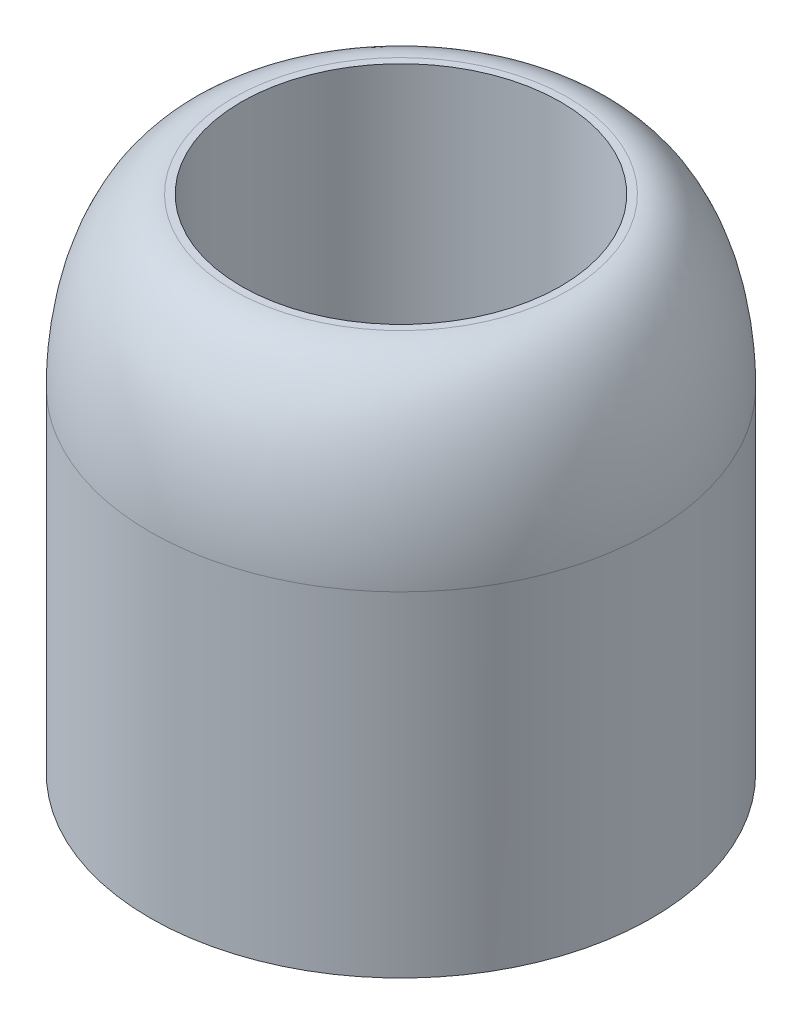
ISO-10303-21;
HEADER;
FILE_DESCRIPTION(('STEP AP214'),'2;1');
FILE_NAME('part.step','',(''),(''),'','','');
FILE_SCHEMA(('AUTOMOTIVE_DESIGN { 1 0 10303 214 1 1 1 1 }'));
ENDSEC;
DATA;
#1=APPLICATION_CONTEXT('core data for automotive mechanical design processes');
#2=APPLICATION_PROTOCOL_DEFINITION('international standard','automotive_design',2000,#1);
#3=PRODUCT_CONTEXT('',#1,'mechanical');
#4=PRODUCT('Part','Part','',(#3));
#5=PRODUCT_RELATED_PRODUCT_CATEGORY('part','',(#4));
#6=PRODUCT_DEFINITION_FORMATION('','',#4);
#7=PRODUCT_DEFINITION_CONTEXT('part definition',#1,'design');
#8=PRODUCT_DEFINITION('design','',#6,#7);
#9=PRODUCT_DEFINITION_SHAPE('','',#8);
#10=(LENGTH_UNIT() NAMED_UNIT(*) SI_UNIT(.MILLI.,.METRE.));
#11=(NAMED_UNIT(*) PLANE_ANGLE_UNIT() SI_UNIT($,.RADIAN.));
#12=(NAMED_UNIT(*) SI_UNIT($,.STERADIAN.) SOLID_ANGLE_UNIT());
#13=UNCERTAINTY_MEASURE_WITH_UNIT(LENGTH_MEASURE(1.E-05),#10,'distance_accuracy_value','');
#14=(GEOMETRIC_REPRESENTATION_CONTEXT(3) GLOBAL_UNCERTAINTY_ASSIGNED_CONTEXT((#13)) GLOBAL_UNIT_ASSIGNED_CONTEXT((#10,
#11,#12)) REPRESENTATION_CONTEXT('',''));
#15=CARTESIAN_POINT('',(0.,0.,0.));
#16=DIRECTION('',(0.,0.,1.));
#17=DIRECTION('',(1.,0.,0.));
#18=AXIS2_PLACEMENT_3D('',#15,#16,#17);
#19=CARTESIAN_POINT('',(0.,60.,0.));
#20=DIRECTION('',(0.,-1.,0.));
#21=DIRECTION('',(0.,0.,-1.));
#22=AXIS2_PLACEMENT_3D('',#19,#20,#21);
#23=CYLINDRICAL_SURFACE('',#22,19.1);
#24=CARTESIAN_POINT('',(0.,60.,0.));
#25=DIRECTION('',(0.,1.,0.));
#26=DIRECTION('',(0.,0.,1.));
#27=AXIS2_PLACEMENT_3D('',#24,#25,#26);
#28=CIRCLE('',#27,19.1);
#29=CARTESIAN_POINT('',(0.,60.,19.1));
#30=VERTEX_POINT('',#29);
#31=EDGE_CURVE('E72',#30,#30,#28,.T.);
#32=ORIENTED_EDGE('',*,*,#31,.T.);
#33=EDGE_LOOP('',(#32));
#34=FACE_BOUND('',#33,.T.);
#35=CARTESIAN_POINT('',(0.,20.,0.));
#36=DIRECTION('',(0.,-1.,0.));
#37=DIRECTION('',(0.,0.,-1.));
#38=AXIS2_PLACEMENT_3D('',#35,#36,#37);
#39=CIRCLE('',#38,19.1);
#40=CARTESIAN_POINT('',(0.,20.,-19.1));
#41=VERTEX_POINT('',#40);
#42=EDGE_CURVE('E78',#41,#41,#39,.T.);
#43=ORIENTED_EDGE('',*,*,#42,.T.);
#44=EDGE_LOOP('',(#43));
#45=FACE_BOUND('',#44,.T.);
#46=ADVANCED_FACE('F46',(#34,#45),#23,.F.);
#47=CARTESIAN_POINT('',(0.,60.,0.));
#48=DIRECTION('',(0.,1.,0.));
#49=DIRECTION('',(0.,0.,1.));
#50=AXIS2_PLACEMENT_3D('',#47,#48,#49);
#51=PLANE('',#50);
#52=CARTESIAN_POINT('',(0.,60.,20.));
#53=CARTESIAN_POINT('',(-2.61799387690403,60.,20.));
#54=CARTESIAN_POINT('',(-5.23495768819361,60.,19.4794535329497));
#55=CARTESIAN_POINT('',(-10.07237960641,60.,17.4757277675017));
#56=CARTESIAN_POINT('',(-12.2909344002713,60.,15.9933368471906));
#57=CARTESIAN_POINT('',(-15.9933368471907,60.,12.2909344002712));
#58=CARTESIAN_POINT('',(-17.4757277675017,60.,10.0723796064088));
#59=CARTESIAN_POINT('',(-19.4794535329498,60.,5.23495768819469));
#60=CARTESIAN_POINT('',(-20.,60.,2.6179938769007));
#61=CARTESIAN_POINT('',(-20.,60.,-2.61799387690063));
#62=CARTESIAN_POINT('',(-19.4794535329497,60.,-5.23495768819361));
#63=CARTESIAN_POINT('',(-17.4757277675017,60.,-10.07237960641));
#64=CARTESIAN_POINT('',(-15.9933368471929,60.,-12.290934400269));
#65=CARTESIAN_POINT('',(-12.290934400269,60.,-15.9933368471929));
#66=CARTESIAN_POINT('',(-10.0723796064088,60.,-17.4757277675017));
#67=CARTESIAN_POINT('',(-5.2349576881947,60.,-19.4794535329498));
#68=CARTESIAN_POINT('',(-2.61799387690066,60.,-20.));
#69=CARTESIAN_POINT('',(2.61799387690067,60.,-20.));
#70=CARTESIAN_POINT('',(5.23495768819248,60.,-19.4794535329452));
#71=CARTESIAN_POINT('',(10.0723796064112,60.,-17.4757277675062));
#72=CARTESIAN_POINT('',(12.290934400269,60.,-15.9933368471929));
#73=CARTESIAN_POINT('',(15.9933368471929,60.,-12.290934400269));
#74=CARTESIAN_POINT('',(17.4757277675062,60.,-10.0723796064118));
#75=CARTESIAN_POINT('',(19.4794535329453,60.,-5.23495768819185));
#76=CARTESIAN_POINT('',(20.,60.,-2.61799387690066));
#77=CARTESIAN_POINT('',(20.,60.,2.61799387690066));
#78=CARTESIAN_POINT('',(19.4794535329499,60.,5.2349576881941));
#79=CARTESIAN_POINT('',(17.4757277675016,60.,10.0723796064095));
#80=CARTESIAN_POINT('',(15.9933368471911,60.,12.2909344002708));
#81=CARTESIAN_POINT('',(12.2909344002708,60.,15.9933368471911));
#82=CARTESIAN_POINT('',(10.0723796064114,60.,17.4757277674994));
#83=CARTESIAN_POINT('',(5.23495768819215,60.,19.4794535329521));
#84=CARTESIAN_POINT('',(2.61799387690402,60.,20.));
#85=CARTESIAN_POINT('',(0.,60.,20.));
#86=(BOUNDED_CURVE() B_SPLINE_CURVE(3,(#52,#53,#54,#55,#56,#57,#58,#59,#60,#61,#62,#63,#64,#65,
#66,#67,#68,#69,#70,#71,#72,#73,#74,#75,#76,#77,#78,#79,#80,#81,#82,#83,#84,#85),.UNSPECIFIED.,
.T.,.F.) B_SPLINE_CURVE_WITH_KNOTS((4,2,2,2,2,2,2,2,2,2,2,2,2,2,2,2,4),(0.,0.392699081698725,
0.785398163397448,1.17809724509617,1.5707963267949,1.96349540849362,2.35619449019234,
2.74889357189107,3.14159265358979,3.53429173528852,3.92699081698724,4.31968989868597,
4.71238898038469,5.10508806208341,5.49778714378214,5.89048622548086,6.28318530717959),
.UNSPECIFIED.) CURVE() GEOMETRIC_REPRESENTATION_ITEM() RATIONAL_B_SPLINE_CURVE((1.,1.,1.,1.,1.,
1.,1.,1.,1.,1.,1.,1.,1.,1.,1.,1.,1.,1.,1.,1.,1.,1.,1.,1.,1.,1.,1.,1.,1.,1.,1.,1.,1.,1.)) REPRESENTATION_ITEM(''));
#87=CARTESIAN_POINT('',(0.,60.,20.));
#88=VERTEX_POINT('',#87);
#89=EDGE_CURVE('E60',#88,#88,#86,.F.);
#90=ORIENTED_EDGE('',*,*,#89,.T.);
#91=EDGE_LOOP('',(#90));
#92=FACE_BOUND('',#91,.T.);
#93=ORIENTED_EDGE('',*,*,#31,.F.);
#94=EDGE_LOOP('',(#93));
#95=FACE_BOUND('',#94,.T.);
#96=ADVANCED_FACE('F90',(#92,#95),#51,.T.);
#97=CARTESIAN_POINT('',(0.,0.,0.));
#98=DIRECTION('',(0.,1.,0.));
#99=DIRECTION('',(0.,0.,1.));
#100=AXIS2_PLACEMENT_3D('',#97,#98,#99);
#101=PLANE('',#100);
#102=CARTESIAN_POINT('',(0.,0.,0.));
#103=DIRECTION('',(0.,-1.,0.));
#104=DIRECTION('',(0.,0.,-1.));
#105=AXIS2_PLACEMENT_3D('',#102,#103,#104);
#106=CIRCLE('',#105,26.);
#107=CARTESIAN_POINT('',(0.,0.,-26.));
#108=VERTEX_POINT('',#107);
#109=EDGE_CURVE('E145',#108,#108,#106,.T.);
#110=ORIENTED_EDGE('',*,*,#109,.F.);
#111=EDGE_LOOP('',(#110));
#112=FACE_BOUND('',#111,.T.);
#113=CARTESIAN_POINT('',(0.,0.,0.));
#114=DIRECTION('',(0.,1.,0.));
#115=DIRECTION('',(0.,0.,1.));
#116=AXIS2_PLACEMENT_3D('',#113,#114,#115);
#117=CIRCLE('',#116,30.);
#118=CARTESIAN_POINT('',(0.,0.,30.));
#119=VERTEX_POINT('',#118);
#120=EDGE_CURVE('E66',#119,#119,#117,.T.);
#121=ORIENTED_EDGE('',*,*,#120,.F.);
#122=EDGE_LOOP('',(#121));
#123=FACE_BOUND('',#122,.T.);
#124=ADVANCED_FACE('F100',(#112,#123),#101,.F.);
#125=CARTESIAN_POINT('',(0.,60.,0.));
#126=DIRECTION('',(0.,-1.,0.));
#127=DIRECTION('',(0.,0.,-1.));
#128=AXIS2_PLACEMENT_3D('',#125,#126,#127);
#129=CYLINDRICAL_SURFACE('',#128,30.);
#130=CARTESIAN_POINT('',(0.,40.,30.));
#131=CARTESIAN_POINT('',(3.92699081535604,40.,30.));
#132=CARTESIAN_POINT('',(7.85243653228777,40.,29.2191802994243));
#133=CARTESIAN_POINT('',(15.1085694096176,40.,26.2135916512529));
#134=CARTESIAN_POINT('',(18.4364016004074,40.,23.9900052707855));
#135=CARTESIAN_POINT('',(23.9900052707855,40.,18.4364016004074));
#136=CARTESIAN_POINT('',(26.2135916512531,40.,15.1085694096173));
#137=CARTESIAN_POINT('',(29.2191802994241,40.,7.85243653228805));
#138=CARTESIAN_POINT('',(30.,40.,3.926990815351));
#139=CARTESIAN_POINT('',(30.,40.,-3.92699081535099));
#140=CARTESIAN_POINT('',(29.2191802994236,40.,-7.85243653228935));
#141=CARTESIAN_POINT('',(26.2135916512536,40.,-15.1085694096161));
#142=CARTESIAN_POINT('',(23.9900052707916,40.,-18.4364016004012));
#143=CARTESIAN_POINT('',(18.4364016004012,40.,-23.9900052707917));
#144=CARTESIAN_POINT('',(15.1085694096135,40.,-26.2135916512546));
#145=CARTESIAN_POINT('',(7.85243653229199,40.,-29.2191802994225));
#146=CARTESIAN_POINT('',(3.926990815351,40.,-30.));
#147=CARTESIAN_POINT('',(-3.92699081535099,40.,-30.));
#148=CARTESIAN_POINT('',(-7.85243653229257,40.,-29.2191802994223));
#149=CARTESIAN_POINT('',(-15.1085694096127,40.,-26.213591651255));
#150=CARTESIAN_POINT('',(-18.4364016004012,40.,-23.9900052707916));
#151=CARTESIAN_POINT('',(-23.9900052707916,40.,-18.4364016004012));
#152=CARTESIAN_POINT('',(-26.2135916512541,40.,-15.1085694096147));
#153=CARTESIAN_POINT('',(-29.2191802994231,40.,-7.85243653229071));
#154=CARTESIAN_POINT('',(-30.,40.,-3.92699081535095));
#155=CARTESIAN_POINT('',(-30.,40.,3.92699081535105));
#156=CARTESIAN_POINT('',(-29.2191802994223,40.,7.85243653229256));
#157=CARTESIAN_POINT('',(-26.213591651255,40.,15.1085694096127));
#158=CARTESIAN_POINT('',(-23.9900052707871,40.,18.4364016004057));
#159=CARTESIAN_POINT('',(-18.4364016004058,40.,23.990005270787));
#160=CARTESIAN_POINT('',(-15.1085694096151,40.,26.213591651254));
#161=CARTESIAN_POINT('',(-7.85243653229038,40.,29.2191802994232));
#162=CARTESIAN_POINT('',(-3.92699081535604,40.,30.));
#163=CARTESIAN_POINT('',(0.,40.,30.));
#164=(BOUNDED_CURVE() B_SPLINE_CURVE(3,(#130,#131,#132,#133,#134,#135,#136,#137,#138,#139,#140,
#141,#142,#143,#144,#145,#146,#147,#148,#149,#150,#151,#152,#153,#154,#155,#156,#157,#158,#159,
#160,#161,#162,#163),.UNSPECIFIED.,.T.,.F.) B_SPLINE_CURVE_WITH_KNOTS((4,2,2,2,2,2,2,2,2,2,2,2,
2,2,2,2,4),(0.,0.392699081698724,0.785398163397448,1.17809724509617,1.5707963267949,
1.96349540849362,2.35619449019234,2.74889357189107,3.14159265358979,3.53429173528852,
3.92699081698724,4.31968989868597,4.71238898038469,5.10508806208341,5.49778714378214,
5.89048622548086,6.28318530717959),
.UNSPECIFIED.) CURVE() GEOMETRIC_REPRESENTATION_ITEM() RATIONAL_B_SPLINE_CURVE((1.,1.,1.,1.,1.,
1.,1.,1.,1.,1.,1.,1.,1.,1.,1.,1.,1.,1.,1.,1.,1.,1.,1.,1.,1.,1.,1.,1.,1.,1.,1.,1.,1.,1.)) REPRESENTATION_ITEM(''));
#165=CARTESIAN_POINT('',(0.,40.,30.));
#166=VERTEX_POINT('',#165);
#167=EDGE_CURVE('E11',#166,#166,#164,.F.);
#168=ORIENTED_EDGE('',*,*,#167,.T.);
#169=EDGE_LOOP('',(#168));
#170=FACE_BOUND('',#169,.T.);
#171=ORIENTED_EDGE('',*,*,#120,.T.);
#172=EDGE_LOOP('',(#171));
#173=FACE_BOUND('',#172,.T.);
#174=ADVANCED_FACE('F103',(#170,#173),#129,.T.);
#175=CARTESIAN_POINT('',(0.,20.,0.));
#176=DIRECTION('',(0.,-1.,0.));
#177=DIRECTION('',(0.,0.,-1.));
#178=AXIS2_PLACEMENT_3D('',#175,#176,#177);
#179=CYLINDRICAL_SURFACE('',#178,26.);
#180=CARTESIAN_POINT('',(0.,20.,0.));
#181=DIRECTION('',(0.,-1.,0.));
#182=DIRECTION('',(0.,0.,-1.));
#183=AXIS2_PLACEMENT_3D('',#180,#181,#182);
#184=CIRCLE('',#183,26.);
#185=CARTESIAN_POINT('',(0.,20.,-26.));
#186=VERTEX_POINT('',#185);
#187=EDGE_CURVE('E84',#186,#186,#184,.T.);
#188=ORIENTED_EDGE('',*,*,#187,.F.);
#189=EDGE_LOOP('',(#188));
#190=FACE_BOUND('',#189,.T.);
#191=ORIENTED_EDGE('',*,*,#109,.T.);
#192=EDGE_LOOP('',(#191));
#193=FACE_BOUND('',#192,.T.);
#194=ADVANCED_FACE('F107',(#190,#193),#179,.F.);
#195=CARTESIAN_POINT('',(0.,20.,0.));
#196=DIRECTION('',(0.,-1.,0.));
#197=DIRECTION('',(0.,0.,-1.));
#198=AXIS2_PLACEMENT_3D('',#195,#196,#197);
#199=PLANE('',#198);
#200=ORIENTED_EDGE('',*,*,#42,.F.);
#201=EDGE_LOOP('',(#200));
#202=FACE_BOUND('',#201,.T.);
#203=ORIENTED_EDGE('',*,*,#187,.T.);
#204=EDGE_LOOP('',(#203));
#205=FACE_BOUND('',#204,.T.);
#206=ADVANCED_FACE('F127',(#202,#205),#199,.T.);
#207=CARTESIAN_POINT('',(0.,60.,20.));
#208=CARTESIAN_POINT('',(2.61799387690402,60.,20.));
#209=CARTESIAN_POINT('',(5.23495768819215,60.,19.4794535329521));
#210=CARTESIAN_POINT('',(10.0723796064114,60.,17.4757277674994));
#211=CARTESIAN_POINT('',(12.2909344002708,60.,15.9933368471911));
#212=CARTESIAN_POINT('',(15.9933368471911,60.,12.2909344002708));
#213=CARTESIAN_POINT('',(17.4757277675016,60.,10.0723796064095));
#214=CARTESIAN_POINT('',(19.4794535329499,60.,5.2349576881941));
#215=CARTESIAN_POINT('',(20.,60.,2.61799387690066));
#216=CARTESIAN_POINT('',(20.,60.,-2.61799387690066));
#217=CARTESIAN_POINT('',(19.4794535329453,60.,-5.23495768819185));
#218=CARTESIAN_POINT('',(17.4757277675062,60.,-10.0723796064118));
#219=CARTESIAN_POINT('',(15.9933368471929,60.,-12.290934400269));
#220=CARTESIAN_POINT('',(12.290934400269,60.,-15.9933368471929));
#221=CARTESIAN_POINT('',(10.0723796064112,60.,-17.4757277675062));
#222=CARTESIAN_POINT('',(5.23495768819248,60.,-19.4794535329452));
#223=CARTESIAN_POINT('',(2.61799387690067,60.,-20.));
#224=CARTESIAN_POINT('',(-2.61799387690066,60.,-20.));
#225=CARTESIAN_POINT('',(-5.2349576881947,60.,-19.4794535329498));
#226=CARTESIAN_POINT('',(-10.0723796064088,60.,-17.4757277675017));
#227=CARTESIAN_POINT('',(-12.290934400269,60.,-15.9933368471929));
#228=CARTESIAN_POINT('',(-15.9933368471929,60.,-12.290934400269));
#229=CARTESIAN_POINT('',(-17.4757277675017,60.,-10.07237960641));
#230=CARTESIAN_POINT('',(-19.4794535329497,60.,-5.23495768819361));
#231=CARTESIAN_POINT('',(-20.,60.,-2.61799387690063));
#232=CARTESIAN_POINT('',(-20.,60.,2.6179938769007));
#233=CARTESIAN_POINT('',(-19.4794535329498,60.,5.23495768819469));
#234=CARTESIAN_POINT('',(-17.4757277675017,60.,10.0723796064088));
#235=CARTESIAN_POINT('',(-15.9933368471907,60.,12.2909344002712));
#236=CARTESIAN_POINT('',(-12.2909344002713,60.,15.9933368471906));
#237=CARTESIAN_POINT('',(-10.07237960641,60.,17.4757277675017));
#238=CARTESIAN_POINT('',(-5.23495768819361,60.,19.4794535329497));
#239=CARTESIAN_POINT('',(-2.61799387690403,60.,20.));
#240=CARTESIAN_POINT('',(0.,60.,20.));
#241=CARTESIAN_POINT('',(0.,60.,30.));
#242=CARTESIAN_POINT('',(3.92699081535604,60.,30.));
#243=CARTESIAN_POINT('',(7.85243653228709,60.,29.2191802994281));
#244=CARTESIAN_POINT('',(15.1085694096183,60.,26.2135916512491));
#245=CARTESIAN_POINT('',(18.4364016004074,60.,23.9900052707855));
#246=CARTESIAN_POINT('',(23.9900052707855,60.,18.4364016004074));
#247=CARTESIAN_POINT('',(26.2135916512524,60.,15.108569409617));
#248=CARTESIAN_POINT('',(29.2191802994248,60.,7.85243653228831));
#249=CARTESIAN_POINT('',(30.,60.,3.926990815351));
#250=CARTESIAN_POINT('',(30.,60.,-3.92699081535099));
#251=CARTESIAN_POINT('',(29.2191802994157,60.,-7.85243653228607));
#252=CARTESIAN_POINT('',(26.2135916512615,60.,-15.1085694096193));
#253=CARTESIAN_POINT('',(23.9900052707962,60.,-18.4364016004012));
#254=CARTESIAN_POINT('',(18.4364016003966,60.,-23.9900052707917));
#255=CARTESIAN_POINT('',(15.1085694096173,60.,-26.2135916512684));
#256=CARTESIAN_POINT('',(7.85243653228815,60.,-29.2191802994087));
#257=CARTESIAN_POINT('',(3.926990815351,60.,-30.));
#258=CARTESIAN_POINT('',(-3.92699081535099,60.,-30.));
#259=CARTESIAN_POINT('',(-7.85243653229488,60.,-29.2191802994224));
#260=CARTESIAN_POINT('',(-15.1085694096104,60.,-26.2135916512549));
#261=CARTESIAN_POINT('',(-18.4364016004012,60.,-23.9900052707962));
#262=CARTESIAN_POINT('',(-23.9900052707916,60.,-18.4364016003967));
#263=CARTESIAN_POINT('',(-26.2135916512548,60.,-15.108569409615));
#264=CARTESIAN_POINT('',(-29.2191802994223,60.,-7.85243653229042));
#265=CARTESIAN_POINT('',(-29.9999999999955,60.,-3.92699081535095));
#266=CARTESIAN_POINT('',(-30.0000000000045,60.,3.92699081535105));
#267=CARTESIAN_POINT('',(-29.2191802994224,60.,7.85243653229261));
#268=CARTESIAN_POINT('',(-26.2135916512549,60.,15.1085694096127));
#269=CARTESIAN_POINT('',(-23.9900052707872,60.,18.4364016004057));
#270=CARTESIAN_POINT('',(-18.4364016004058,60.,23.990005270787));
#271=CARTESIAN_POINT('',(-15.1085694096173,60.,26.2135916512594));
#272=CARTESIAN_POINT('',(-7.85243653228815,60.,29.2191802994178));
#273=CARTESIAN_POINT('',(-3.92699081535604,60.,30.));
#274=CARTESIAN_POINT('',(0.,60.,30.));
#275=CARTESIAN_POINT('',(0.,40.,30.));
#276=CARTESIAN_POINT('',(3.92699081535604,40.,30.));
#277=CARTESIAN_POINT('',(7.85243653228777,40.,29.2191802994243));
#278=CARTESIAN_POINT('',(15.1085694096176,40.,26.2135916512529));
#279=CARTESIAN_POINT('',(18.4364016004074,40.,23.9900052707855));
#280=CARTESIAN_POINT('',(23.9900052707855,40.,18.4364016004074));
#281=CARTESIAN_POINT('',(26.2135916512531,40.,15.1085694096173));
#282=CARTESIAN_POINT('',(29.2191802994241,40.,7.85243653228805));
#283=CARTESIAN_POINT('',(30.,40.,3.926990815351));
#284=CARTESIAN_POINT('',(30.,40.,-3.92699081535099));
#285=CARTESIAN_POINT('',(29.2191802994236,40.,-7.85243653228935));
#286=CARTESIAN_POINT('',(26.2135916512536,40.,-15.1085694096161));
#287=CARTESIAN_POINT('',(23.9900052707916,40.,-18.4364016004012));
#288=CARTESIAN_POINT('',(18.4364016004012,40.,-23.9900052707917));
#289=CARTESIAN_POINT('',(15.1085694096135,40.,-26.2135916512546));
#290=CARTESIAN_POINT('',(7.85243653229199,40.,-29.2191802994225));
#291=CARTESIAN_POINT('',(3.926990815351,40.,-30.));
#292=CARTESIAN_POINT('',(-3.92699081535099,40.,-30.));
#293=CARTESIAN_POINT('',(-7.85243653229257,40.,-29.2191802994223));
#294=CARTESIAN_POINT('',(-15.1085694096127,40.,-26.213591651255));
#295=CARTESIAN_POINT('',(-18.4364016004012,40.,-23.9900052707916));
#296=CARTESIAN_POINT('',(-23.9900052707916,40.,-18.4364016004012));
#297=CARTESIAN_POINT('',(-26.2135916512541,40.,-15.1085694096147));
#298=CARTESIAN_POINT('',(-29.2191802994231,40.,-7.85243653229071));
#299=CARTESIAN_POINT('',(-30.,40.,-3.92699081535095));
#300=CARTESIAN_POINT('',(-30.,40.,3.92699081535105));
#301=CARTESIAN_POINT('',(-29.2191802994223,40.,7.85243653229256));
#302=CARTESIAN_POINT('',(-26.213591651255,40.,15.1085694096127));
#303=CARTESIAN_POINT('',(-23.9900052707871,40.,18.4364016004057));
#304=CARTESIAN_POINT('',(-18.4364016004058,40.,23.990005270787));
#305=CARTESIAN_POINT('',(-15.1085694096151,40.,26.213591651254));
#306=CARTESIAN_POINT('',(-7.85243653229038,40.,29.2191802994232));
#307=CARTESIAN_POINT('',(-3.92699081535604,40.,30.));
#308=CARTESIAN_POINT('',(0.,40.,30.));
#309=(BOUNDED_SURFACE() B_SPLINE_SURFACE(2,3,((#207,#208,#209,#210,#211,#212,#213,#214,#215,
#216,#217,#218,#219,#220,#221,#222,#223,#224,#225,#226,#227,#228,#229,#230,#231,#232,#233,#234,
#235,#236,#237,#238,#239,#240),(#241,#242,#243,#244,#245,#246,#247,#248,#249,#250,#251,#252,
#253,#254,#255,#256,#257,#258,#259,#260,#261,#262,#263,#264,#265,#266,#267,#268,#269,#270,#271,
#272,#273,#274),(#275,#276,#277,#278,#279,#280,#281,#282,#283,#284,#285,#286,#287,#288,#289,
#290,#291,#292,#293,#294,#295,#296,#297,#298,#299,#300,#301,#302,#303,#304,#305,#306,#307,
#308)),.UNSPECIFIED.,.F.,.T.,.F.) B_SPLINE_SURFACE_WITH_KNOTS((3,3),(4,2,2,2,2,2,2,2,2,2,2,2,2,
2,2,2,4),(0.,1.),(0.,0.392699081698724,0.785398163397448,1.17809724509617,1.5707963267949,
1.96349540849362,2.35619449019234,2.74889357189107,3.14159265358979,3.53429173528852,
3.92699081698724,4.31968989868597,4.71238898038469,5.10508806208341,5.49778714378214,
5.89048622548086,6.28318530717959),
.UNSPECIFIED.) GEOMETRIC_REPRESENTATION_ITEM() RATIONAL_B_SPLINE_SURFACE(((1.,1.,1.,1.,1.,1.,1.,
1.,1.,1.,1.,1.,1.,1.,1.,1.,1.,1.,1.,1.,1.,1.,1.,1.,1.,1.,1.,1.,1.,1.,1.,1.,1.,1.),
(0.707106781186548,0.707106781186548,0.707106781186548,0.707106781186548,0.707106781186548,
0.707106781186548,0.707106781186548,0.707106781186548,0.707106781186548,0.707106781186548,
0.707106781186548,0.707106781186548,0.707106781186548,0.707106781186548,0.707106781186548,
0.707106781186548,0.707106781186548,0.707106781186548,0.707106781186548,0.707106781186548,
0.707106781186548,0.707106781186548,0.707106781186548,0.707106781186548,0.707106781186548,
0.707106781186548,0.707106781186548,0.707106781186548,0.707106781186548,0.707106781186548,
0.707106781186548,0.707106781186548,0.707106781186548,0.707106781186548),(1.,1.,1.,1.,1.,1.,1.,
1.,1.,1.,1.,1.,1.,1.,1.,1.,1.,1.,1.,1.,1.,1.,1.,1.,1.,1.,1.,1.,1.,1.,1.,1.,1.,1.))) REPRESENTATION_ITEM('') SURFACE());
#310=ORIENTED_EDGE('',*,*,#167,.F.);
#311=EDGE_LOOP('',(#310));
#312=FACE_BOUND('',#311,.T.);
#313=ORIENTED_EDGE('',*,*,#89,.F.);
#314=EDGE_LOOP('',(#313));
#315=FACE_BOUND('',#314,.T.);
#316=ADVANCED_FACE('F49',(#312,#315),#309,.T.);
#317=CLOSED_SHELL('',(#46,#96,#124,#174,#194,#206,#316));
#318=MANIFOLD_SOLID_BREP('B2',#317);
#319=ADVANCED_BREP_SHAPE_REPRESENTATION('',(#18,#318),#14);
#320=SHAPE_DEFINITION_REPRESENTATION(#9,#319);
ENDSEC;
END-ISO-10303-21;
